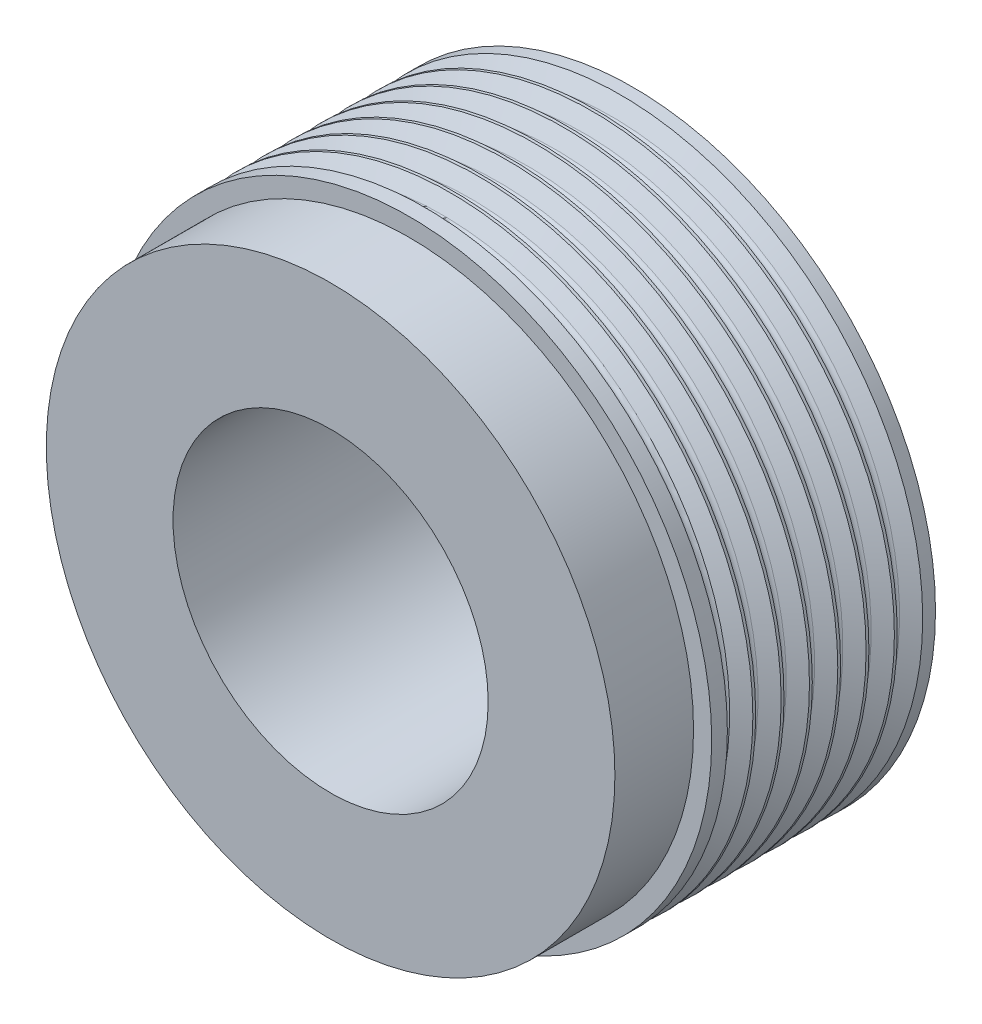
ISO-10303-21;
HEADER;
FILE_DESCRIPTION(('STEP AP214'),'2;1');
FILE_NAME('part.step','',(''),(''),'','','');
FILE_SCHEMA(('AUTOMOTIVE_DESIGN { 1 0 10303 214 1 1 1 1 }'));
ENDSEC;
DATA;
#1=APPLICATION_CONTEXT('core data for automotive mechanical design processes');
#2=APPLICATION_PROTOCOL_DEFINITION('international standard','automotive_design',2000,#1);
#3=PRODUCT_CONTEXT('',#1,'mechanical');
#4=PRODUCT('Part','Part','',(#3));
#5=PRODUCT_RELATED_PRODUCT_CATEGORY('part','',(#4));
#6=PRODUCT_DEFINITION_FORMATION('','',#4);
#7=PRODUCT_DEFINITION_CONTEXT('part definition',#1,'design');
#8=PRODUCT_DEFINITION('design','',#6,#7);
#9=PRODUCT_DEFINITION_SHAPE('','',#8);
#10=(LENGTH_UNIT() NAMED_UNIT(*) SI_UNIT(.MILLI.,.METRE.));
#11=(NAMED_UNIT(*) PLANE_ANGLE_UNIT() SI_UNIT($,.RADIAN.));
#12=(NAMED_UNIT(*) SI_UNIT($,.STERADIAN.) SOLID_ANGLE_UNIT());
#13=UNCERTAINTY_MEASURE_WITH_UNIT(LENGTH_MEASURE(1.E-05),#10,'distance_accuracy_value','');
#14=(GEOMETRIC_REPRESENTATION_CONTEXT(3) GLOBAL_UNCERTAINTY_ASSIGNED_CONTEXT((#13)) GLOBAL_UNIT_ASSIGNED_CONTEXT((#10,
#11,#12)) REPRESENTATION_CONTEXT('',''));
#15=CARTESIAN_POINT('',(0.,0.,0.));
#16=DIRECTION('',(0.,0.,1.));
#17=DIRECTION('',(1.,0.,0.));
#18=AXIS2_PLACEMENT_3D('',#15,#16,#17);
#19=CARTESIAN_POINT('',(0.,0.,25.));
#20=DIRECTION('',(0.,0.,-1.));
#21=DIRECTION('',(-1.,0.,0.));
#22=AXIS2_PLACEMENT_3D('',#19,#20,#21);
#23=CYLINDRICAL_SURFACE('',#22,25.);
#24=CARTESIAN_POINT('',(0.,0.,1.05849999999999));
#25=DIRECTION('',(0.,0.,-1.));
#26=DIRECTION('',(-1.,0.,0.));
#27=AXIS2_PLACEMENT_3D('',#24,#25,#26);
#28=CIRCLE('',#27,25.);
#29=CARTESIAN_POINT('',(-25.,0.,1.05849999999999));
#30=VERTEX_POINT('',#29);
#31=EDGE_CURVE('E48',#30,#30,#28,.T.);
#32=ORIENTED_EDGE('',*,*,#31,.T.);
#33=EDGE_LOOP('',(#32));
#34=FACE_BOUND('',#33,.T.);
#35=CARTESIAN_POINT('',(0.,0.,0.));
#36=DIRECTION('',(0.,0.,1.));
#37=DIRECTION('',(1.,0.,0.));
#38=AXIS2_PLACEMENT_3D('',#35,#36,#37);
#39=CIRCLE('',#38,25.);
#40=CARTESIAN_POINT('',(25.,0.,0.));
#41=VERTEX_POINT('',#40);
#42=EDGE_CURVE('E12',#41,#41,#39,.T.);
#43=ORIENTED_EDGE('',*,*,#42,.T.);
#44=EDGE_LOOP('',(#43));
#45=FACE_BOUND('',#44,.T.);
#46=ADVANCED_FACE('F44',(#34,#45),#23,.T.);
#47=CARTESIAN_POINT('',(0.,0.,17.2045));
#48=DIRECTION('',(0.,0.,1.));
#49=DIRECTION('',(1.,0.,0.));
#50=AXIS2_PLACEMENT_3D('',#47,#48,#49);
#51=CIRCLE('',#50,25.);
#52=CARTESIAN_POINT('',(25.,0.,17.2045));
#53=VERTEX_POINT('',#52);
#54=EDGE_CURVE('E61',#53,#53,#51,.T.);
#55=ORIENTED_EDGE('',*,*,#54,.T.);
#56=EDGE_LOOP('',(#55));
#57=FACE_BOUND('',#56,.T.);
#58=CARTESIAN_POINT('',(0.,0.,18.5));
#59=DIRECTION('',(0.,0.,1.));
#60=DIRECTION('',(1.,0.,0.));
#61=AXIS2_PLACEMENT_3D('',#58,#59,#60);
#62=CIRCLE('',#61,25.);
#63=CARTESIAN_POINT('',(25.,0.,18.5));
#64=VERTEX_POINT('',#63);
#65=EDGE_CURVE('E52',#64,#64,#62,.T.);
#66=ORIENTED_EDGE('',*,*,#65,.F.);
#67=EDGE_LOOP('',(#66));
#68=FACE_BOUND('',#67,.T.);
#69=ADVANCED_FACE('F46',(#57,#68),#23,.T.);
#70=CARTESIAN_POINT('',(0.,0.,0.));
#71=DIRECTION('',(0.,0.,1.));
#72=DIRECTION('',(1.,0.,0.));
#73=AXIS2_PLACEMENT_3D('',#70,#71,#72);
#74=PLANE('',#73);
#75=CARTESIAN_POINT('',(0.,0.,0.));
#76=DIRECTION('',(0.,0.,1.));
#77=DIRECTION('',(1.,0.,0.));
#78=AXIS2_PLACEMENT_3D('',#75,#76,#77);
#79=CIRCLE('',#78,13.025);
#80=CARTESIAN_POINT('',(13.025,0.,0.));
#81=VERTEX_POINT('',#80);
#82=EDGE_CURVE('E106',#81,#81,#79,.T.);
#83=ORIENTED_EDGE('',*,*,#82,.T.);
#84=EDGE_LOOP('',(#83));
#85=FACE_BOUND('',#84,.T.);
#86=ORIENTED_EDGE('',*,*,#42,.F.);
#87=EDGE_LOOP('',(#86));
#88=FACE_BOUND('',#87,.T.);
#89=ADVANCED_FACE('F133',(#85,#88),#74,.F.);
#90=CARTESIAN_POINT('',(0.,0.,18.5));
#91=DIRECTION('',(0.,0.,1.));
#92=DIRECTION('',(1.,0.,0.));
#93=AXIS2_PLACEMENT_3D('',#90,#91,#92);
#94=PLANE('',#93);
#95=CARTESIAN_POINT('',(0.,0.,18.5));
#96=DIRECTION('',(0.,0.,1.));
#97=DIRECTION('',(1.,0.,0.));
#98=AXIS2_PLACEMENT_3D('',#95,#96,#97);
#99=CIRCLE('',#98,23.5);
#100=CARTESIAN_POINT('',(23.5,0.,18.5));
#101=VERTEX_POINT('',#100);
#102=EDGE_CURVE('E57',#101,#101,#99,.T.);
#103=ORIENTED_EDGE('',*,*,#102,.F.);
#104=EDGE_LOOP('',(#103));
#105=FACE_BOUND('',#104,.T.);
#106=ORIENTED_EDGE('',*,*,#65,.T.);
#107=EDGE_LOOP('',(#106));
#108=FACE_BOUND('',#107,.T.);
#109=ADVANCED_FACE('F123',(#105,#108),#94,.T.);
#110=CARTESIAN_POINT('',(0.,0.,18.5));
#111=DIRECTION('',(0.,0.,1.));
#112=DIRECTION('',(1.,0.,0.));
#113=AXIS2_PLACEMENT_3D('',#110,#111,#112);
#114=CYLINDRICAL_SURFACE('',#113,23.5);
#115=ORIENTED_EDGE('',*,*,#102,.T.);
#116=EDGE_LOOP('',(#115));
#117=FACE_BOUND('',#116,.T.);
#118=CARTESIAN_POINT('',(0.,0.,25.));
#119=DIRECTION('',(0.,0.,1.));
#120=DIRECTION('',(1.,0.,0.));
#121=AXIS2_PLACEMENT_3D('',#118,#119,#120);
#122=CIRCLE('',#121,23.5);
#123=CARTESIAN_POINT('',(23.5,0.,25.));
#124=VERTEX_POINT('',#123);
#125=EDGE_CURVE('E111',#124,#124,#122,.T.);
#126=ORIENTED_EDGE('',*,*,#125,.F.);
#127=EDGE_LOOP('',(#126));
#128=FACE_BOUND('',#127,.T.);
#129=ADVANCED_FACE('F121',(#117,#128),#114,.T.);
#130=CARTESIAN_POINT('',(0.,0.,25.));
#131=DIRECTION('',(0.,0.,1.));
#132=DIRECTION('',(1.,0.,0.));
#133=AXIS2_PLACEMENT_3D('',#130,#131,#132);
#134=PLANE('',#133);
#135=CARTESIAN_POINT('',(0.,0.,25.));
#136=DIRECTION('',(0.,0.,1.));
#137=DIRECTION('',(1.,0.,0.));
#138=AXIS2_PLACEMENT_3D('',#135,#136,#137);
#139=CIRCLE('',#138,13.025);
#140=CARTESIAN_POINT('',(13.025,0.,25.));
#141=VERTEX_POINT('',#140);
#142=EDGE_CURVE('E102',#141,#141,#139,.T.);
#143=ORIENTED_EDGE('',*,*,#142,.F.);
#144=EDGE_LOOP('',(#143));
#145=FACE_BOUND('',#144,.T.);
#146=ORIENTED_EDGE('',*,*,#125,.T.);
#147=EDGE_LOOP('',(#146));
#148=FACE_BOUND('',#147,.T.);
#149=ADVANCED_FACE('F119',(#145,#148),#134,.T.);
#150=CARTESIAN_POINT('',(0.,0.,0.));
#151=DIRECTION('',(0.,0.,1.));
#152=DIRECTION('',(1.,0.,0.));
#153=AXIS2_PLACEMENT_3D('',#150,#151,#152);
#154=CYLINDRICAL_SURFACE('',#153,13.025);
#155=ORIENTED_EDGE('',*,*,#82,.F.);
#156=EDGE_LOOP('',(#155));
#157=FACE_BOUND('',#156,.T.);
#158=ORIENTED_EDGE('',*,*,#142,.T.);
#159=EDGE_LOOP('',(#158));
#160=FACE_BOUND('',#159,.T.);
#161=ADVANCED_FACE('F130',(#157,#160),#154,.F.);
#162=CARTESIAN_POINT('',(0.,0.,15.8062391546757));
#163=DIRECTION('',(0.,0.,-1.));
#164=DIRECTION('',(-1.,0.,0.));
#165=AXIS2_PLACEMENT_3D('',#162,#163,#164);
#166=CONICAL_SURFACE('',#165,23.7901894791867,1.04147925707583);
#167=CARTESIAN_POINT('',(0.,0.,15.8062391546757));
#168=DIRECTION('',(0.,0.,-1.));
#169=DIRECTION('',(-1.,0.,0.));
#170=AXIS2_PLACEMENT_3D('',#167,#168,#169);
#171=CIRCLE('',#170,23.7901894791867);
#172=CARTESIAN_POINT('',(-23.7901894791867,0.,15.8062391546757));
#173=VERTEX_POINT('',#172);
#174=EDGE_CURVE('E308',#173,#173,#171,.T.);
#175=ORIENTED_EDGE('',*,*,#174,.T.);
#176=EDGE_LOOP('',(#175));
#177=FACE_BOUND('',#176,.T.);
#178=CARTESIAN_POINT('',(0.,0.,15.0984999999999));
#179=DIRECTION('',(0.,0.,-1.));
#180=DIRECTION('',(-1.,0.,0.));
#181=AXIS2_PLACEMENT_3D('',#178,#179,#180);
#182=CIRCLE('',#181,25.);
#183=CARTESIAN_POINT('',(-25.,0.,15.0984999999999));
#184=VERTEX_POINT('',#183);
#185=EDGE_CURVE('E64',#184,#184,#182,.T.);
#186=ORIENTED_EDGE('',*,*,#185,.F.);
#187=EDGE_LOOP('',(#186));
#188=FACE_BOUND('',#187,.T.);
#189=ADVANCED_FACE('F235',(#177,#188),#166,.T.);
#190=CARTESIAN_POINT('',(0.,0.,17.263));
#191=DIRECTION('',(0.,0.,1.));
#192=DIRECTION('',(1.,0.,0.));
#193=AXIS2_PLACEMENT_3D('',#190,#191,#192);
#194=CONICAL_SURFACE('',#193,25.0999999999999,1.04147925707585);
#195=CARTESIAN_POINT('',(0.,0.,16.4967608453243));
#196=DIRECTION('',(0.,0.,-1.));
#197=DIRECTION('',(-1.,0.,0.));
#198=AXIS2_PLACEMENT_3D('',#195,#196,#197);
#199=CIRCLE('',#198,23.7901894791867);
#200=CARTESIAN_POINT('',(-23.7901894791867,0.,16.4967608453243));
#201=VERTEX_POINT('',#200);
#202=EDGE_CURVE('E311',#201,#201,#199,.T.);
#203=ORIENTED_EDGE('',*,*,#202,.F.);
#204=EDGE_LOOP('',(#203));
#205=FACE_BOUND('',#204,.T.);
#206=ORIENTED_EDGE('',*,*,#54,.F.);
#207=EDGE_LOOP('',(#206));
#208=FACE_BOUND('',#207,.T.);
#209=ADVANCED_FACE('F228',(#205,#208),#194,.T.);
#210=CARTESIAN_POINT('',(0.,0.,16.1515));
#211=DIRECTION('',(0.,0.,-1.));
#212=DIRECTION('',(-1.,0.,0.));
#213=AXIS2_PLACEMENT_3D('',#210,#211,#212);
#214=TOROIDAL_SURFACE('',#213,23.9921670737014,0.399999999999999);
#215=ORIENTED_EDGE('',*,*,#174,.F.);
#216=EDGE_LOOP('',(#215));
#217=FACE_BOUND('',#216,.T.);
#218=ORIENTED_EDGE('',*,*,#202,.T.);
#219=EDGE_LOOP('',(#218));
#220=FACE_BOUND('',#219,.T.);
#221=ADVANCED_FACE('F220',(#217,#220),#214,.F.);
#222=CARTESIAN_POINT('',(0.,0.,14.8645));
#223=DIRECTION('',(0.,0.,1.));
#224=DIRECTION('',(1.,0.,0.));
#225=AXIS2_PLACEMENT_3D('',#222,#223,#224);
#226=CIRCLE('',#225,25.);
#227=CARTESIAN_POINT('',(25.,0.,14.8645));
#228=VERTEX_POINT('',#227);
#229=EDGE_CURVE('E68',#228,#228,#226,.T.);
#230=ORIENTED_EDGE('',*,*,#229,.T.);
#231=EDGE_LOOP('',(#230));
#232=FACE_BOUND('',#231,.T.);
#233=ORIENTED_EDGE('',*,*,#185,.T.);
#234=EDGE_LOOP('',(#233));
#235=FACE_BOUND('',#234,.T.);
#236=ADVANCED_FACE('F143',(#232,#235),#23,.T.);
#237=CARTESIAN_POINT('',(0.,0.,13.4662391546757));
#238=DIRECTION('',(0.,0.,-1.));
#239=DIRECTION('',(-1.,0.,0.));
#240=AXIS2_PLACEMENT_3D('',#237,#238,#239);
#241=CONICAL_SURFACE('',#240,23.7901894791867,1.04147925707583);
#242=CARTESIAN_POINT('',(0.,0.,13.4662391546757));
#243=DIRECTION('',(0.,0.,-1.));
#244=DIRECTION('',(-1.,0.,0.));
#245=AXIS2_PLACEMENT_3D('',#242,#243,#244);
#246=CIRCLE('',#245,23.7901894791867);
#247=CARTESIAN_POINT('',(-23.7901894791867,0.,13.4662391546757));
#248=VERTEX_POINT('',#247);
#249=EDGE_CURVE('E302',#248,#248,#246,.T.);
#250=ORIENTED_EDGE('',*,*,#249,.T.);
#251=EDGE_LOOP('',(#250));
#252=FACE_BOUND('',#251,.T.);
#253=CARTESIAN_POINT('',(0.,0.,12.7584999999999));
#254=DIRECTION('',(0.,0.,-1.));
#255=DIRECTION('',(-1.,0.,0.));
#256=AXIS2_PLACEMENT_3D('',#253,#254,#255);
#257=CIRCLE('',#256,25.);
#258=CARTESIAN_POINT('',(-25.,0.,12.7584999999999));
#259=VERTEX_POINT('',#258);
#260=EDGE_CURVE('E71',#259,#259,#257,.T.);
#261=ORIENTED_EDGE('',*,*,#260,.F.);
#262=EDGE_LOOP('',(#261));
#263=FACE_BOUND('',#262,.T.);
#264=ADVANCED_FACE('F219',(#252,#263),#241,.T.);
#265=CARTESIAN_POINT('',(0.,0.,14.923));
#266=DIRECTION('',(0.,0.,1.));
#267=DIRECTION('',(1.,0.,0.));
#268=AXIS2_PLACEMENT_3D('',#265,#266,#267);
#269=CONICAL_SURFACE('',#268,25.0999999999999,1.04147925707584);
#270=CARTESIAN_POINT('',(0.,0.,14.1567608453243));
#271=DIRECTION('',(0.,0.,-1.));
#272=DIRECTION('',(-1.,0.,0.));
#273=AXIS2_PLACEMENT_3D('',#270,#271,#272);
#274=CIRCLE('',#273,23.7901894791867);
#275=CARTESIAN_POINT('',(-23.7901894791867,0.,14.1567608453243));
#276=VERTEX_POINT('',#275);
#277=EDGE_CURVE('E305',#276,#276,#274,.T.);
#278=ORIENTED_EDGE('',*,*,#277,.F.);
#279=EDGE_LOOP('',(#278));
#280=FACE_BOUND('',#279,.T.);
#281=ORIENTED_EDGE('',*,*,#229,.F.);
#282=EDGE_LOOP('',(#281));
#283=FACE_BOUND('',#282,.T.);
#284=ADVANCED_FACE('F214',(#280,#283),#269,.T.);
#285=CARTESIAN_POINT('',(0.,0.,13.8115));
#286=DIRECTION('',(0.,0.,-1.));
#287=DIRECTION('',(-1.,0.,0.));
#288=AXIS2_PLACEMENT_3D('',#285,#286,#287);
#289=TOROIDAL_SURFACE('',#288,23.9921670737015,0.399999999999999);
#290=ORIENTED_EDGE('',*,*,#249,.F.);
#291=EDGE_LOOP('',(#290));
#292=FACE_BOUND('',#291,.T.);
#293=ORIENTED_EDGE('',*,*,#277,.T.);
#294=EDGE_LOOP('',(#293));
#295=FACE_BOUND('',#294,.T.);
#296=ADVANCED_FACE('F206',(#292,#295),#289,.F.);
#297=CARTESIAN_POINT('',(0.,0.,12.5245));
#298=DIRECTION('',(0.,0.,1.));
#299=DIRECTION('',(1.,0.,0.));
#300=AXIS2_PLACEMENT_3D('',#297,#298,#299);
#301=CIRCLE('',#300,25.);
#302=CARTESIAN_POINT('',(25.,0.,12.5245));
#303=VERTEX_POINT('',#302);
#304=EDGE_CURVE('E74',#303,#303,#301,.T.);
#305=ORIENTED_EDGE('',*,*,#304,.T.);
#306=EDGE_LOOP('',(#305));
#307=FACE_BOUND('',#306,.T.);
#308=ORIENTED_EDGE('',*,*,#260,.T.);
#309=EDGE_LOOP('',(#308));
#310=FACE_BOUND('',#309,.T.);
#311=ADVANCED_FACE('F193',(#307,#310),#23,.T.);
#312=CARTESIAN_POINT('',(0.,0.,11.1262391546757));
#313=DIRECTION('',(0.,0.,-1.));
#314=DIRECTION('',(-1.,0.,0.));
#315=AXIS2_PLACEMENT_3D('',#312,#313,#314);
#316=CONICAL_SURFACE('',#315,23.7901894791868,1.04147925707583);
#317=CARTESIAN_POINT('',(0.,0.,11.1262391546757));
#318=DIRECTION('',(0.,0.,-1.));
#319=DIRECTION('',(-1.,0.,0.));
#320=AXIS2_PLACEMENT_3D('',#317,#318,#319);
#321=CIRCLE('',#320,23.7901894791868);
#322=CARTESIAN_POINT('',(-23.7901894791868,0.,11.1262391546757));
#323=VERTEX_POINT('',#322);
#324=EDGE_CURVE('E296',#323,#323,#321,.T.);
#325=ORIENTED_EDGE('',*,*,#324,.T.);
#326=EDGE_LOOP('',(#325));
#327=FACE_BOUND('',#326,.T.);
#328=CARTESIAN_POINT('',(0.,0.,10.4184999999999));
#329=DIRECTION('',(0.,0.,-1.));
#330=DIRECTION('',(-1.,0.,0.));
#331=AXIS2_PLACEMENT_3D('',#328,#329,#330);
#332=CIRCLE('',#331,25.);
#333=CARTESIAN_POINT('',(-25.,0.,10.4184999999999));
#334=VERTEX_POINT('',#333);
#335=EDGE_CURVE('E77',#334,#334,#332,.T.);
#336=ORIENTED_EDGE('',*,*,#335,.F.);
#337=EDGE_LOOP('',(#336));
#338=FACE_BOUND('',#337,.T.);
#339=ADVANCED_FACE('F205',(#327,#338),#316,.T.);
#340=CARTESIAN_POINT('',(0.,0.,12.583));
#341=DIRECTION('',(0.,0.,1.));
#342=DIRECTION('',(1.,0.,0.));
#343=AXIS2_PLACEMENT_3D('',#340,#341,#342);
#344=CONICAL_SURFACE('',#343,25.0999999999999,1.04147925707584);
#345=CARTESIAN_POINT('',(0.,0.,11.8167608453243));
#346=DIRECTION('',(0.,0.,-1.));
#347=DIRECTION('',(-1.,0.,0.));
#348=AXIS2_PLACEMENT_3D('',#345,#346,#347);
#349=CIRCLE('',#348,23.7901894791868);
#350=CARTESIAN_POINT('',(-23.7901894791868,0.,11.8167608453243));
#351=VERTEX_POINT('',#350);
#352=EDGE_CURVE('E299',#351,#351,#349,.T.);
#353=ORIENTED_EDGE('',*,*,#352,.F.);
#354=EDGE_LOOP('',(#353));
#355=FACE_BOUND('',#354,.T.);
#356=ORIENTED_EDGE('',*,*,#304,.F.);
#357=EDGE_LOOP('',(#356));
#358=FACE_BOUND('',#357,.T.);
#359=ADVANCED_FACE('F200',(#355,#358),#344,.T.);
#360=CARTESIAN_POINT('',(0.,0.,11.4715));
#361=DIRECTION('',(0.,0.,-1.));
#362=DIRECTION('',(-1.,0.,0.));
#363=AXIS2_PLACEMENT_3D('',#360,#361,#362);
#364=TOROIDAL_SURFACE('',#363,23.9921670737015,0.399999999999999);
#365=ORIENTED_EDGE('',*,*,#324,.F.);
#366=EDGE_LOOP('',(#365));
#367=FACE_BOUND('',#366,.T.);
#368=ORIENTED_EDGE('',*,*,#352,.T.);
#369=EDGE_LOOP('',(#368));
#370=FACE_BOUND('',#369,.T.);
#371=ADVANCED_FACE('F191',(#367,#370),#364,.F.);
#372=CARTESIAN_POINT('',(0.,0.,10.1845));
#373=DIRECTION('',(0.,0.,1.));
#374=DIRECTION('',(1.,0.,0.));
#375=AXIS2_PLACEMENT_3D('',#372,#373,#374);
#376=CIRCLE('',#375,25.);
#377=CARTESIAN_POINT('',(25.,0.,10.1845));
#378=VERTEX_POINT('',#377);
#379=EDGE_CURVE('E80',#378,#378,#376,.T.);
#380=ORIENTED_EDGE('',*,*,#379,.T.);
#381=EDGE_LOOP('',(#380));
#382=FACE_BOUND('',#381,.T.);
#383=ORIENTED_EDGE('',*,*,#335,.T.);
#384=EDGE_LOOP('',(#383));
#385=FACE_BOUND('',#384,.T.);
#386=ADVANCED_FACE('F178',(#382,#385),#23,.T.);
#387=CARTESIAN_POINT('',(0.,0.,8.78623915467569));
#388=DIRECTION('',(0.,0.,-1.));
#389=DIRECTION('',(-1.,0.,0.));
#390=AXIS2_PLACEMENT_3D('',#387,#388,#389);
#391=CONICAL_SURFACE('',#390,23.7901894791868,1.04147925707583);
#392=CARTESIAN_POINT('',(0.,0.,8.78623915467569));
#393=DIRECTION('',(0.,0.,-1.));
#394=DIRECTION('',(-1.,0.,0.));
#395=AXIS2_PLACEMENT_3D('',#392,#393,#394);
#396=CIRCLE('',#395,23.7901894791868);
#397=CARTESIAN_POINT('',(-23.7901894791868,0.,8.78623915467569));
#398=VERTEX_POINT('',#397);
#399=EDGE_CURVE('E290',#398,#398,#396,.T.);
#400=ORIENTED_EDGE('',*,*,#399,.T.);
#401=EDGE_LOOP('',(#400));
#402=FACE_BOUND('',#401,.T.);
#403=CARTESIAN_POINT('',(0.,0.,8.07849999999994));
#404=DIRECTION('',(0.,0.,-1.));
#405=DIRECTION('',(-1.,0.,0.));
#406=AXIS2_PLACEMENT_3D('',#403,#404,#405);
#407=CIRCLE('',#406,25.);
#408=CARTESIAN_POINT('',(-25.,0.,8.07849999999994));
#409=VERTEX_POINT('',#408);
#410=EDGE_CURVE('E83',#409,#409,#407,.T.);
#411=ORIENTED_EDGE('',*,*,#410,.F.);
#412=EDGE_LOOP('',(#411));
#413=FACE_BOUND('',#412,.T.);
#414=ADVANCED_FACE('F190',(#402,#413),#391,.T.);
#415=CARTESIAN_POINT('',(0.,0.,10.243));
#416=DIRECTION('',(0.,0.,1.));
#417=DIRECTION('',(1.,0.,0.));
#418=AXIS2_PLACEMENT_3D('',#415,#416,#417);
#419=CONICAL_SURFACE('',#418,25.1,1.04147925707584);
#420=CARTESIAN_POINT('',(0.,0.,9.47676084532429));
#421=DIRECTION('',(0.,0.,-1.));
#422=DIRECTION('',(-1.,0.,0.));
#423=AXIS2_PLACEMENT_3D('',#420,#421,#422);
#424=CIRCLE('',#423,23.7901894791868);
#425=CARTESIAN_POINT('',(-23.7901894791868,0.,9.47676084532429));
#426=VERTEX_POINT('',#425);
#427=EDGE_CURVE('E293',#426,#426,#424,.T.);
#428=ORIENTED_EDGE('',*,*,#427,.F.);
#429=EDGE_LOOP('',(#428));
#430=FACE_BOUND('',#429,.T.);
#431=ORIENTED_EDGE('',*,*,#379,.F.);
#432=EDGE_LOOP('',(#431));
#433=FACE_BOUND('',#432,.T.);
#434=ADVANCED_FACE('F185',(#430,#433),#419,.T.);
#435=CARTESIAN_POINT('',(0.,0.,9.13149999999999));
#436=DIRECTION('',(0.,0.,-1.));
#437=DIRECTION('',(-1.,0.,0.));
#438=AXIS2_PLACEMENT_3D('',#435,#436,#437);
#439=TOROIDAL_SURFACE('',#438,23.9921670737015,0.399999999999999);
#440=ORIENTED_EDGE('',*,*,#399,.F.);
#441=EDGE_LOOP('',(#440));
#442=FACE_BOUND('',#441,.T.);
#443=ORIENTED_EDGE('',*,*,#427,.T.);
#444=EDGE_LOOP('',(#443));
#445=FACE_BOUND('',#444,.T.);
#446=ADVANCED_FACE('F176',(#442,#445),#439,.F.);
#447=CARTESIAN_POINT('',(0.,0.,7.84450000000002));
#448=DIRECTION('',(0.,0.,1.));
#449=DIRECTION('',(1.,0.,0.));
#450=AXIS2_PLACEMENT_3D('',#447,#448,#449);
#451=CIRCLE('',#450,25.);
#452=CARTESIAN_POINT('',(25.,0.,7.84450000000002));
#453=VERTEX_POINT('',#452);
#454=EDGE_CURVE('E86',#453,#453,#451,.T.);
#455=ORIENTED_EDGE('',*,*,#454,.T.);
#456=EDGE_LOOP('',(#455));
#457=FACE_BOUND('',#456,.T.);
#458=ORIENTED_EDGE('',*,*,#410,.T.);
#459=EDGE_LOOP('',(#458));
#460=FACE_BOUND('',#459,.T.);
#461=ADVANCED_FACE('F163',(#457,#460),#23,.T.);
#462=CARTESIAN_POINT('',(0.,0.,6.44623915467569));
#463=DIRECTION('',(0.,0.,-1.));
#464=DIRECTION('',(-1.,0.,0.));
#465=AXIS2_PLACEMENT_3D('',#462,#463,#464);
#466=CONICAL_SURFACE('',#465,23.7901894791868,1.04147925707584);
#467=CARTESIAN_POINT('',(0.,0.,6.44623915467569));
#468=DIRECTION('',(0.,0.,-1.));
#469=DIRECTION('',(-1.,0.,0.));
#470=AXIS2_PLACEMENT_3D('',#467,#468,#469);
#471=CIRCLE('',#470,23.7901894791868);
#472=CARTESIAN_POINT('',(-23.7901894791868,0.,6.44623915467569));
#473=VERTEX_POINT('',#472);
#474=EDGE_CURVE('E285',#473,#473,#471,.T.);
#475=ORIENTED_EDGE('',*,*,#474,.T.);
#476=EDGE_LOOP('',(#475));
#477=FACE_BOUND('',#476,.T.);
#478=CARTESIAN_POINT('',(0.,0.,5.73849999999996));
#479=DIRECTION('',(0.,0.,-1.));
#480=DIRECTION('',(-1.,0.,0.));
#481=AXIS2_PLACEMENT_3D('',#478,#479,#480);
#482=CIRCLE('',#481,25.);
#483=CARTESIAN_POINT('',(-25.,0.,5.73849999999996));
#484=VERTEX_POINT('',#483);
#485=EDGE_CURVE('E89',#484,#484,#482,.T.);
#486=ORIENTED_EDGE('',*,*,#485,.F.);
#487=EDGE_LOOP('',(#486));
#488=FACE_BOUND('',#487,.T.);
#489=ADVANCED_FACE('F175',(#477,#488),#466,.T.);
#490=CARTESIAN_POINT('',(0.,0.,7.903));
#491=DIRECTION('',(0.,0.,1.));
#492=DIRECTION('',(1.,0.,0.));
#493=AXIS2_PLACEMENT_3D('',#490,#491,#492);
#494=CONICAL_SURFACE('',#493,25.1,1.04147925707584);
#495=CARTESIAN_POINT('',(0.,0.,7.13676084532429));
#496=DIRECTION('',(0.,0.,-1.));
#497=DIRECTION('',(-1.,0.,0.));
#498=AXIS2_PLACEMENT_3D('',#495,#496,#497);
#499=CIRCLE('',#498,23.7901894791868);
#500=CARTESIAN_POINT('',(-23.7901894791868,0.,7.13676084532429));
#501=VERTEX_POINT('',#500);
#502=EDGE_CURVE('E287',#501,#501,#499,.T.);
#503=ORIENTED_EDGE('',*,*,#502,.F.);
#504=EDGE_LOOP('',(#503));
#505=FACE_BOUND('',#504,.T.);
#506=ORIENTED_EDGE('',*,*,#454,.F.);
#507=EDGE_LOOP('',(#506));
#508=FACE_BOUND('',#507,.T.);
#509=ADVANCED_FACE('F170',(#505,#508),#494,.T.);
#510=CARTESIAN_POINT('',(0.,0.,6.79149999999999));
#511=DIRECTION('',(0.,0.,-1.));
#512=DIRECTION('',(-1.,0.,0.));
#513=AXIS2_PLACEMENT_3D('',#510,#511,#512);
#514=TOROIDAL_SURFACE('',#513,23.9921670737015,0.399999999999999);
#515=ORIENTED_EDGE('',*,*,#474,.F.);
#516=EDGE_LOOP('',(#515));
#517=FACE_BOUND('',#516,.T.);
#518=ORIENTED_EDGE('',*,*,#502,.T.);
#519=EDGE_LOOP('',(#518));
#520=FACE_BOUND('',#519,.T.);
#521=ADVANCED_FACE('F161',(#517,#520),#514,.F.);
#522=CARTESIAN_POINT('',(0.,0.,5.50450000000001));
#523=DIRECTION('',(0.,0.,1.));
#524=DIRECTION('',(1.,0.,0.));
#525=AXIS2_PLACEMENT_3D('',#522,#523,#524);
#526=CIRCLE('',#525,25.);
#527=CARTESIAN_POINT('',(25.,0.,5.50450000000001));
#528=VERTEX_POINT('',#527);
#529=EDGE_CURVE('E92',#528,#528,#526,.T.);
#530=ORIENTED_EDGE('',*,*,#529,.T.);
#531=EDGE_LOOP('',(#530));
#532=FACE_BOUND('',#531,.T.);
#533=ORIENTED_EDGE('',*,*,#485,.T.);
#534=EDGE_LOOP('',(#533));
#535=FACE_BOUND('',#534,.T.);
#536=ADVANCED_FACE('F147',(#532,#535),#23,.T.);
#537=CARTESIAN_POINT('',(0.,0.,4.1062391546757));
#538=DIRECTION('',(0.,0.,-1.));
#539=DIRECTION('',(-1.,0.,0.));
#540=AXIS2_PLACEMENT_3D('',#537,#538,#539);
#541=CONICAL_SURFACE('',#540,23.7901894791868,1.04147925707584);
#542=CARTESIAN_POINT('',(0.,0.,4.1062391546757));
#543=DIRECTION('',(0.,0.,-1.));
#544=DIRECTION('',(-1.,0.,0.));
#545=AXIS2_PLACEMENT_3D('',#542,#543,#544);
#546=CIRCLE('',#545,23.7901894791868);
#547=CARTESIAN_POINT('',(-23.7901894791868,0.,4.1062391546757));
#548=VERTEX_POINT('',#547);
#549=EDGE_CURVE('E276',#548,#548,#546,.T.);
#550=ORIENTED_EDGE('',*,*,#549,.T.);
#551=EDGE_LOOP('',(#550));
#552=FACE_BOUND('',#551,.T.);
#553=CARTESIAN_POINT('',(0.,0.,3.39849999999997));
#554=DIRECTION('',(0.,0.,-1.));
#555=DIRECTION('',(-1.,0.,0.));
#556=AXIS2_PLACEMENT_3D('',#553,#554,#555);
#557=CIRCLE('',#556,25.);
#558=CARTESIAN_POINT('',(-25.,0.,3.39849999999997));
#559=VERTEX_POINT('',#558);
#560=EDGE_CURVE('E95',#559,#559,#557,.T.);
#561=ORIENTED_EDGE('',*,*,#560,.F.);
#562=EDGE_LOOP('',(#561));
#563=FACE_BOUND('',#562,.T.);
#564=ADVANCED_FACE('F160',(#552,#563),#541,.T.);
#565=CARTESIAN_POINT('',(0.,0.,5.563));
#566=DIRECTION('',(0.,0.,1.));
#567=DIRECTION('',(1.,0.,0.));
#568=AXIS2_PLACEMENT_3D('',#565,#566,#567);
#569=CONICAL_SURFACE('',#568,25.1,1.04147925707584);
#570=CARTESIAN_POINT('',(0.,0.,4.79676084532429));
#571=DIRECTION('',(0.,0.,-1.));
#572=DIRECTION('',(-1.,0.,0.));
#573=AXIS2_PLACEMENT_3D('',#570,#571,#572);
#574=CIRCLE('',#573,23.7901894791868);
#575=CARTESIAN_POINT('',(-23.7901894791868,0.,4.79676084532429));
#576=VERTEX_POINT('',#575);
#577=EDGE_CURVE('E281',#576,#576,#574,.T.);
#578=ORIENTED_EDGE('',*,*,#577,.F.);
#579=EDGE_LOOP('',(#578));
#580=FACE_BOUND('',#579,.T.);
#581=ORIENTED_EDGE('',*,*,#529,.F.);
#582=EDGE_LOOP('',(#581));
#583=FACE_BOUND('',#582,.T.);
#584=ADVANCED_FACE('F155',(#580,#583),#569,.T.);
#585=CARTESIAN_POINT('',(0.,0.,4.4515));
#586=DIRECTION('',(0.,0.,-1.));
#587=DIRECTION('',(-1.,0.,0.));
#588=AXIS2_PLACEMENT_3D('',#585,#586,#587);
#589=TOROIDAL_SURFACE('',#588,23.9921670737015,0.399999999999999);
#590=ORIENTED_EDGE('',*,*,#549,.F.);
#591=EDGE_LOOP('',(#590));
#592=FACE_BOUND('',#591,.T.);
#593=ORIENTED_EDGE('',*,*,#577,.T.);
#594=EDGE_LOOP('',(#593));
#595=FACE_BOUND('',#594,.T.);
#596=ADVANCED_FACE('F146',(#592,#595),#589,.F.);
#597=CARTESIAN_POINT('',(0.,0.,3.16450000000001));
#598=DIRECTION('',(0.,0.,1.));
#599=DIRECTION('',(1.,0.,0.));
#600=AXIS2_PLACEMENT_3D('',#597,#598,#599);
#601=CIRCLE('',#600,25.);
#602=CARTESIAN_POINT('',(25.,0.,3.16450000000001));
#603=VERTEX_POINT('',#602);
#604=EDGE_CURVE('E97',#603,#603,#601,.T.);
#605=ORIENTED_EDGE('',*,*,#604,.T.);
#606=EDGE_LOOP('',(#605));
#607=FACE_BOUND('',#606,.T.);
#608=ORIENTED_EDGE('',*,*,#560,.T.);
#609=EDGE_LOOP('',(#608));
#610=FACE_BOUND('',#609,.T.);
#611=ADVANCED_FACE('F138',(#607,#610),#23,.T.);
#612=CARTESIAN_POINT('',(0.,0.,1.7662391546757));
#613=DIRECTION('',(0.,0.,-1.));
#614=DIRECTION('',(-1.,0.,0.));
#615=AXIS2_PLACEMENT_3D('',#612,#613,#614);
#616=CONICAL_SURFACE('',#615,23.7901894791868,1.04147925707584);
#617=CARTESIAN_POINT('',(0.,0.,1.7662391546757));
#618=DIRECTION('',(0.,0.,-1.));
#619=DIRECTION('',(-1.,0.,0.));
#620=AXIS2_PLACEMENT_3D('',#617,#618,#619);
#621=CIRCLE('',#620,23.7901894791868);
#622=CARTESIAN_POINT('',(-23.7901894791868,0.,1.7662391546757));
#623=VERTEX_POINT('',#622);
#624=EDGE_CURVE('E65',#623,#623,#621,.T.);
#625=ORIENTED_EDGE('',*,*,#624,.T.);
#626=EDGE_LOOP('',(#625));
#627=FACE_BOUND('',#626,.T.);
#628=ORIENTED_EDGE('',*,*,#31,.F.);
#629=EDGE_LOOP('',(#628));
#630=FACE_BOUND('',#629,.T.);
#631=ADVANCED_FACE('F145',(#627,#630),#616,.T.);
#632=CARTESIAN_POINT('',(0.,0.,3.22300000000001));
#633=DIRECTION('',(0.,0.,1.));
#634=DIRECTION('',(1.,0.,0.));
#635=AXIS2_PLACEMENT_3D('',#632,#633,#634);
#636=CONICAL_SURFACE('',#635,25.1,1.04147925707584);
#637=CARTESIAN_POINT('',(0.,0.,2.4567608453243));
#638=DIRECTION('',(0.,0.,-1.));
#639=DIRECTION('',(-1.,0.,0.));
#640=AXIS2_PLACEMENT_3D('',#637,#638,#639);
#641=CIRCLE('',#640,23.7901894791868);
#642=CARTESIAN_POINT('',(-23.7901894791868,0.,2.4567608453243));
#643=VERTEX_POINT('',#642);
#644=EDGE_CURVE('E274',#643,#643,#641,.T.);
#645=ORIENTED_EDGE('',*,*,#644,.F.);
#646=EDGE_LOOP('',(#645));
#647=FACE_BOUND('',#646,.T.);
#648=ORIENTED_EDGE('',*,*,#604,.F.);
#649=EDGE_LOOP('',(#648));
#650=FACE_BOUND('',#649,.T.);
#651=ADVANCED_FACE('F152',(#647,#650),#636,.T.);
#652=CARTESIAN_POINT('',(0.,0.,2.1115));
#653=DIRECTION('',(0.,0.,-1.));
#654=DIRECTION('',(-1.,0.,0.));
#655=AXIS2_PLACEMENT_3D('',#652,#653,#654);
#656=TOROIDAL_SURFACE('',#655,23.9921670737015,0.399999999999999);
#657=ORIENTED_EDGE('',*,*,#624,.F.);
#658=EDGE_LOOP('',(#657));
#659=FACE_BOUND('',#658,.T.);
#660=ORIENTED_EDGE('',*,*,#644,.T.);
#661=EDGE_LOOP('',(#660));
#662=FACE_BOUND('',#661,.T.);
#663=ADVANCED_FACE('F263',(#659,#662),#656,.F.);
#664=CLOSED_SHELL('',(#46,#69,#89,#109,#129,#149,#161,#189,#209,#221,#236,#264,#284,#296,#311,
#339,#359,#371,#386,#414,#434,#446,#461,#489,#509,#521,#536,#564,#584,#596,#611,#631,#651,#663));
#665=MANIFOLD_SOLID_BREP('B2',#664);
#666=ADVANCED_BREP_SHAPE_REPRESENTATION('',(#18,#665),#14);
#667=SHAPE_DEFINITION_REPRESENTATION(#9,#666);
ENDSEC;
END-ISO-10303-21;
